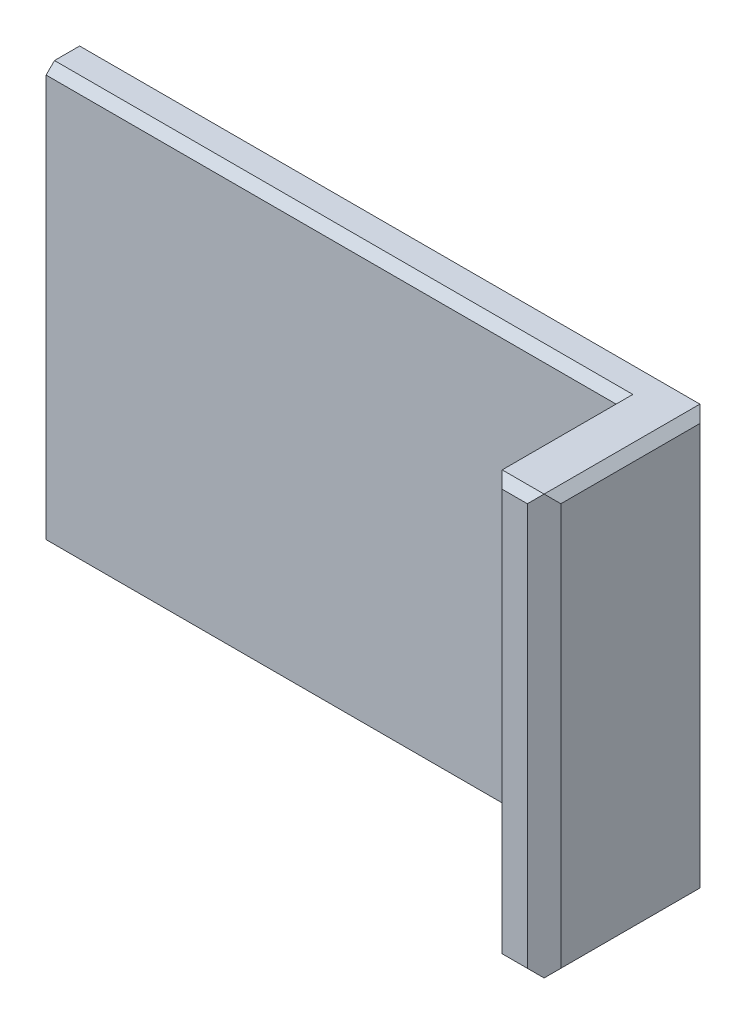
ISO-10303-21;
HEADER;
FILE_DESCRIPTION(('STEP AP214'),'2;1');
FILE_NAME('part.step','',(''),(''),'','','');
FILE_SCHEMA(('AUTOMOTIVE_DESIGN { 1 0 10303 214 1 1 1 1 }'));
ENDSEC;
DATA;
#1=APPLICATION_CONTEXT('core data for automotive mechanical design processes');
#2=APPLICATION_PROTOCOL_DEFINITION('international standard','automotive_design',2000,#1);
#3=PRODUCT_CONTEXT('',#1,'mechanical');
#4=PRODUCT('Part','Part','',(#3));
#5=PRODUCT_RELATED_PRODUCT_CATEGORY('part','',(#4));
#6=PRODUCT_DEFINITION_FORMATION('','',#4);
#7=PRODUCT_DEFINITION_CONTEXT('part definition',#1,'design');
#8=PRODUCT_DEFINITION('design','',#6,#7);
#9=PRODUCT_DEFINITION_SHAPE('','',#8);
#10=(LENGTH_UNIT() NAMED_UNIT(*) SI_UNIT(.MILLI.,.METRE.));
#11=(NAMED_UNIT(*) PLANE_ANGLE_UNIT() SI_UNIT($,.RADIAN.));
#12=(NAMED_UNIT(*) SI_UNIT($,.STERADIAN.) SOLID_ANGLE_UNIT());
#13=UNCERTAINTY_MEASURE_WITH_UNIT(LENGTH_MEASURE(1.E-05),#10,'distance_accuracy_value','');
#14=(GEOMETRIC_REPRESENTATION_CONTEXT(3) GLOBAL_UNCERTAINTY_ASSIGNED_CONTEXT((#13)) GLOBAL_UNIT_ASSIGNED_CONTEXT((#10,
#11,#12)) REPRESENTATION_CONTEXT('',''));
#15=CARTESIAN_POINT('',(0.,0.,0.));
#16=DIRECTION('',(0.,0.,1.));
#17=DIRECTION('',(1.,0.,0.));
#18=AXIS2_PLACEMENT_3D('',#15,#16,#17);
#19=CARTESIAN_POINT('',(5.,64.,0.));
#20=DIRECTION('',(1.,0.,0.));
#21=DIRECTION('',(0.,0.,-1.));
#22=AXIS2_PLACEMENT_3D('',#19,#20,#21);
#23=PLANE('',#22);
#24=CARTESIAN_POINT('',(5.,37.5,-7.5));
#25=DIRECTION('',(-1.,0.,0.));
#26=DIRECTION('',(0.,0.,1.));
#27=AXIS2_PLACEMENT_3D('',#24,#25,#26);
#28=CIRCLE('',#27,2.5);
#29=CARTESIAN_POINT('',(5.,37.5,-5.));
#30=VERTEX_POINT('',#29);
#31=EDGE_CURVE('E831',#30,#30,#28,.T.);
#32=ORIENTED_EDGE('',*,*,#31,.F.);
#33=EDGE_LOOP('',(#32));
#34=FACE_BOUND('',#33,.T.);
#35=CARTESIAN_POINT('',(5.,25.,-7.5));
#36=DIRECTION('',(-1.,0.,0.));
#37=DIRECTION('',(0.,0.,1.));
#38=AXIS2_PLACEMENT_3D('',#35,#36,#37);
#39=CIRCLE('',#38,2.5);
#40=CARTESIAN_POINT('',(5.,25.,-5.));
#41=VERTEX_POINT('',#40);
#42=EDGE_CURVE('E839',#41,#41,#39,.T.);
#43=ORIENTED_EDGE('',*,*,#42,.F.);
#44=EDGE_LOOP('',(#43));
#45=FACE_BOUND('',#44,.T.);
#46=CARTESIAN_POINT('',(5.,12.5,-7.5));
#47=DIRECTION('',(-1.,0.,0.));
#48=DIRECTION('',(0.,0.,1.));
#49=AXIS2_PLACEMENT_3D('',#46,#47,#48);
#50=CIRCLE('',#49,2.5);
#51=CARTESIAN_POINT('',(5.,12.5,-5.));
#52=VERTEX_POINT('',#51);
#53=EDGE_CURVE('E845',#52,#52,#50,.T.);
#54=ORIENTED_EDGE('',*,*,#53,.F.);
#55=EDGE_LOOP('',(#54));
#56=FACE_BOUND('',#55,.T.);
#57=DIRECTION('',(0.,0.707106781186546,-0.707106781186549));
#58=VECTOR('',#57,1.);
#59=CARTESIAN_POINT('',(5.,50.,-1.00000000000001));
#60=LINE('',#59,#58);
#61=CARTESIAN_POINT('',(5.,49.,0.));
#62=VERTEX_POINT('',#61);
#63=CARTESIAN_POINT('',(5.,50.,-1.00000000000001));
#64=VERTEX_POINT('',#63);
#65=EDGE_CURVE('E853',#62,#64,#60,.T.);
#66=ORIENTED_EDGE('',*,*,#65,.T.);
#67=DIRECTION('',(0.,0.,-1.));
#68=VECTOR('',#67,1.);
#69=CARTESIAN_POINT('',(5.,50.,0.));
#70=LINE('',#69,#68);
#71=CARTESIAN_POINT('',(5.,50.,-3.99999999999994));
#72=VERTEX_POINT('',#71);
#73=EDGE_CURVE('E851',#64,#72,#70,.T.);
#74=ORIENTED_EDGE('',*,*,#73,.T.);
#75=DIRECTION('',(0.,-0.707106781186546,-0.707106781186549));
#76=VECTOR('',#75,1.);
#77=CARTESIAN_POINT('',(5.,39.,-15.));
#78=LINE('',#77,#76);
#79=CARTESIAN_POINT('',(5.,39.,-15.));
#80=VERTEX_POINT('',#79);
#81=EDGE_CURVE('E849',#72,#80,#78,.T.);
#82=ORIENTED_EDGE('',*,*,#81,.T.);
#83=DIRECTION('',(0.,1.,0.));
#84=VECTOR('',#83,1.);
#85=CARTESIAN_POINT('',(5.,0.,-15.));
#86=LINE('',#85,#84);
#87=CARTESIAN_POINT('',(5.,11.,-15.));
#88=VERTEX_POINT('',#87);
#89=EDGE_CURVE('E618',#88,#80,#86,.T.);
#90=ORIENTED_EDGE('',*,*,#89,.F.);
#91=DIRECTION('',(0.,0.707106781186547,-0.707106781186548));
#92=VECTOR('',#91,1.);
#93=CARTESIAN_POINT('',(5.,11.,-15.));
#94=LINE('',#93,#92);
#95=CARTESIAN_POINT('',(5.,0.,-3.99999999999999));
#96=VERTEX_POINT('',#95);
#97=EDGE_CURVE('E725',#88,#96,#94,.F.);
#98=ORIENTED_EDGE('',*,*,#97,.T.);
#99=DIRECTION('',(0.,0.,1.));
#100=VECTOR('',#99,1.);
#101=CARTESIAN_POINT('',(5.,0.,0.));
#102=LINE('',#101,#100);
#103=CARTESIAN_POINT('',(5.,0.,-1.00000000000003));
#104=VERTEX_POINT('',#103);
#105=EDGE_CURVE('E727',#96,#104,#102,.T.);
#106=ORIENTED_EDGE('',*,*,#105,.T.);
#107=DIRECTION('',(0.,-0.707106781186538,-0.707106781186557));
#108=VECTOR('',#107,1.);
#109=CARTESIAN_POINT('',(5.,1.,0.));
#110=LINE('',#109,#108);
#111=CARTESIAN_POINT('',(5.,1.,0.));
#112=VERTEX_POINT('',#111);
#113=EDGE_CURVE('E855',#104,#112,#110,.F.);
#114=ORIENTED_EDGE('',*,*,#113,.T.);
#115=DIRECTION('',(0.,-1.,0.));
#116=VECTOR('',#115,1.);
#117=CARTESIAN_POINT('',(5.,50.,0.));
#118=LINE('',#117,#116);
#119=EDGE_CURVE('E872',#62,#112,#118,.T.);
#120=ORIENTED_EDGE('',*,*,#119,.F.);
#121=EDGE_LOOP('',(#66,#74,#82,#90,#98,#106,#114,#120));
#122=FACE_BOUND('',#121,.T.);
#123=ADVANCED_FACE('F600',(#34,#45,#56,#122),#23,.F.);
#124=CARTESIAN_POINT('',(0.,49.,-5.));
#125=DIRECTION('',(0.,-0.707106781186549,0.707106781186546));
#126=DIRECTION('',(1.,0.,0.));
#127=AXIS2_PLACEMENT_3D('',#124,#125,#126);
#128=PLANE('',#127);
#129=DIRECTION('',(0.,0.707106781186546,0.707106781186549));
#130=VECTOR('',#129,1.);
#131=CARTESIAN_POINT('',(23.4800344912998,20.0000000000001,-34.));
#132=LINE('',#131,#130);
#133=CARTESIAN_POINT('',(23.4800344912998,50.,-3.99999999999999));
#134=VERTEX_POINT('',#133);
#135=CARTESIAN_POINT('',(23.4800344912998,39.,-15.));
#136=VERTEX_POINT('',#135);
#137=EDGE_CURVE('E746',#134,#136,#132,.F.);
#138=ORIENTED_EDGE('',*,*,#137,.F.);
#139=DIRECTION('',(-1.,0.,0.));
#140=VECTOR('',#139,1.);
#141=CARTESIAN_POINT('',(0.,50.,-3.99999999999999));
#142=LINE('',#141,#140);
#143=CARTESIAN_POINT('',(79.,50.,-3.99999999999999));
#144=VERTEX_POINT('',#143);
#145=EDGE_CURVE('E887',#144,#134,#142,.T.);
#146=ORIENTED_EDGE('',*,*,#145,.F.);
#147=DIRECTION('',(0.577350269189621,0.577350269189627,0.57735026918963));
#148=VECTOR('',#147,1.);
#149=CARTESIAN_POINT('',(52.0000000000005,23.0000000000002,-31.));
#150=LINE('',#149,#148);
#151=CARTESIAN_POINT('',(78.0000000000001,49.,-4.99999999999999));
#152=VERTEX_POINT('',#151);
#153=EDGE_CURVE('E937',#144,#152,#150,.F.);
#154=ORIENTED_EDGE('',*,*,#153,.T.);
#155=DIRECTION('',(1.,0.,0.));
#156=VECTOR('',#155,1.);
#157=CARTESIAN_POINT('',(0.,49.,-5.));
#158=LINE('',#157,#156);
#159=CARTESIAN_POINT('',(33.4800344912997,49.,-5.));
#160=VERTEX_POINT('',#159);
#161=EDGE_CURVE('E892',#160,#152,#158,.T.);
#162=ORIENTED_EDGE('',*,*,#161,.F.);
#163=DIRECTION('',(0.577350269189624,0.577350269189625,0.577350269189628));
#164=VECTOR('',#163,1.);
#165=CARTESIAN_POINT('',(10.8133678246331,26.3333333333334,-27.6666666666667));
#166=LINE('',#165,#164);
#167=EDGE_CURVE('E755',#160,#136,#166,.F.);
#168=ORIENTED_EDGE('',*,*,#167,.T.);
#169=EDGE_LOOP('',(#138,#146,#154,#162,#168));
#170=FACE_BOUND('',#169,.T.);
#171=ADVANCED_FACE('F794',(#170),#128,.F.);
#172=CARTESIAN_POINT('',(0.,0.,-3.99999999999997));
#173=DIRECTION('',(0.,-0.707106781186557,-0.707106781186538));
#174=DIRECTION('',(-1.,0.,0.));
#175=AXIS2_PLACEMENT_3D('',#172,#173,#174);
#176=PLANE('',#175);
#177=DIRECTION('',(1.,0.,0.));
#178=VECTOR('',#177,1.);
#179=CARTESIAN_POINT('',(80.,0.,-3.99999999999997));
#180=LINE('',#179,#178);
#181=CARTESIAN_POINT('',(23.4800344912998,0.,-3.99999999999997));
#182=VERTEX_POINT('',#181);
#183=CARTESIAN_POINT('',(79.,0.,-3.99999999999997));
#184=VERTEX_POINT('',#183);
#185=EDGE_CURVE('E916',#182,#184,#180,.T.);
#186=ORIENTED_EDGE('',*,*,#185,.F.);
#187=DIRECTION('',(0.,-0.707106781186538,0.707106781186557));
#188=VECTOR('',#187,1.);
#189=CARTESIAN_POINT('',(23.4800344912998,6.,-10.0000000000001));
#190=LINE('',#189,#188);
#191=CARTESIAN_POINT('',(23.4800344912998,10.9999999999997,-15.));
#192=VERTEX_POINT('',#191);
#193=EDGE_CURVE('E742',#192,#182,#190,.T.);
#194=ORIENTED_EDGE('',*,*,#193,.F.);
#195=DIRECTION('',(0.577350269189628,-0.577350269189617,0.577350269189633));
#196=VECTOR('',#195,1.);
#197=CARTESIAN_POINT('',(26.813367824633,7.66666666666659,-11.6666666666668));
#198=LINE('',#197,#196);
#199=CARTESIAN_POINT('',(33.4800344912997,1.,-5.));
#200=VERTEX_POINT('',#199);
#201=EDGE_CURVE('E626',#192,#200,#198,.T.);
#202=ORIENTED_EDGE('',*,*,#201,.T.);
#203=DIRECTION('',(-1.,0.,0.));
#204=VECTOR('',#203,1.);
#205=CARTESIAN_POINT('',(0.,1.,-5.));
#206=LINE('',#205,#204);
#207=CARTESIAN_POINT('',(78.0000000000001,1.,-4.99999999999999));
#208=VERTEX_POINT('',#207);
#209=EDGE_CURVE('E890',#208,#200,#206,.T.);
#210=ORIENTED_EDGE('',*,*,#209,.F.);
#211=DIRECTION('',(0.577350269189625,-0.577350269189618,0.577350269189634));
#212=VECTOR('',#211,1.);
#213=CARTESIAN_POINT('',(52.6666666666667,26.333333333333,-30.3333333333337));
#214=LINE('',#213,#212);
#215=EDGE_CURVE('E927',#208,#184,#214,.T.);
#216=ORIENTED_EDGE('',*,*,#215,.T.);
#217=EDGE_LOOP('',(#186,#194,#202,#210,#216));
#218=FACE_BOUND('',#217,.T.);
#219=ADVANCED_FACE('F800',(#218),#176,.T.);
#220=CARTESIAN_POINT('',(0.,50.,0.));
#221=DIRECTION('',(0.,0.,-1.));
#222=DIRECTION('',(-1.,0.,0.));
#223=AXIS2_PLACEMENT_3D('',#220,#221,#222);
#224=PLANE('',#223);
#225=DIRECTION('',(0.,-1.,0.));
#226=VECTOR('',#225,1.);
#227=CARTESIAN_POINT('',(73.,50.,0.));
#228=LINE('',#227,#226);
#229=CARTESIAN_POINT('',(73.,49.,0.));
#230=VERTEX_POINT('',#229);
#231=CARTESIAN_POINT('',(73.,1.,0.));
#232=VERTEX_POINT('',#231);
#233=EDGE_CURVE('E869',#230,#232,#228,.T.);
#234=ORIENTED_EDGE('',*,*,#233,.F.);
#235=DIRECTION('',(-1.,0.,0.));
#236=VECTOR('',#235,1.);
#237=CARTESIAN_POINT('',(5.,49.,0.));
#238=LINE('',#237,#236);
#239=EDGE_CURVE('E913',#230,#62,#238,.T.);
#240=ORIENTED_EDGE('',*,*,#239,.T.);
#241=ORIENTED_EDGE('',*,*,#119,.T.);
#242=DIRECTION('',(1.,0.,0.));
#243=VECTOR('',#242,1.);
#244=CARTESIAN_POINT('',(0.,1.,0.));
#245=LINE('',#244,#243);
#246=EDGE_CURVE('E911',#112,#232,#245,.T.);
#247=ORIENTED_EDGE('',*,*,#246,.T.);
#248=EDGE_LOOP('',(#234,#240,#241,#247));
#249=FACE_BOUND('',#248,.T.);
#250=ADVANCED_FACE('F1032',(#249),#224,.F.);
#251=CARTESIAN_POINT('',(0.,50.,-5.));
#252=DIRECTION('',(0.,0.,-1.));
#253=DIRECTION('',(-1.,0.,0.));
#254=AXIS2_PLACEMENT_3D('',#251,#252,#253);
#255=PLANE('',#254);
#256=ORIENTED_EDGE('',*,*,#209,.T.);
#257=DIRECTION('',(0.,1.,0.));
#258=VECTOR('',#257,1.);
#259=CARTESIAN_POINT('',(33.4800344912997,50.,-5.));
#260=LINE('',#259,#258);
#261=EDGE_CURVE('E745',#200,#160,#260,.T.);
#262=ORIENTED_EDGE('',*,*,#261,.T.);
#263=ORIENTED_EDGE('',*,*,#161,.T.);
#264=DIRECTION('',(0.,-1.,0.));
#265=VECTOR('',#264,1.);
#266=CARTESIAN_POINT('',(78.0000000000001,1.,-4.99999999999999));
#267=LINE('',#266,#265);
#268=EDGE_CURVE('E934',#152,#208,#267,.T.);
#269=ORIENTED_EDGE('',*,*,#268,.T.);
#270=EDGE_LOOP('',(#256,#262,#263,#269));
#271=FACE_BOUND('',#270,.T.);
#272=ADVANCED_FACE('F1183',(#271),#255,.T.);
#273=CARTESIAN_POINT('',(0.,50.,0.));
#274=DIRECTION('',(0.,1.,0.));
#275=DIRECTION('',(0.,0.,1.));
#276=AXIS2_PLACEMENT_3D('',#273,#274,#275);
#277=PLANE('',#276);
#278=ORIENTED_EDGE('',*,*,#73,.F.);
#279=DIRECTION('',(1.,0.,0.));
#280=VECTOR('',#279,1.);
#281=CARTESIAN_POINT('',(73.,50.,-1.00000000000001));
#282=LINE('',#281,#280);
#283=CARTESIAN_POINT('',(74.,50.,-1.00000000000001));
#284=VERTEX_POINT('',#283);
#285=EDGE_CURVE('E876',#64,#284,#282,.T.);
#286=ORIENTED_EDGE('',*,*,#285,.T.);
#287=DIRECTION('',(0.,0.,1.));
#288=VECTOR('',#287,1.);
#289=CARTESIAN_POINT('',(74.,50.,0.));
#290=LINE('',#289,#288);
#291=CARTESIAN_POINT('',(74.,50.,14.5866666666667));
#292=VERTEX_POINT('',#291);
#293=EDGE_CURVE('E878',#284,#292,#290,.T.);
#294=ORIENTED_EDGE('',*,*,#293,.T.);
#295=DIRECTION('',(1.,0.,0.));
#296=VECTOR('',#295,1.);
#297=CARTESIAN_POINT('',(80.,50.,14.5866666666667));
#298=LINE('',#297,#296);
#299=CARTESIAN_POINT('',(79.,50.,14.5866666666667));
#300=VERTEX_POINT('',#299);
#301=EDGE_CURVE('E881',#292,#300,#298,.T.);
#302=ORIENTED_EDGE('',*,*,#301,.T.);
#303=DIRECTION('',(0.,0.,-1.));
#304=VECTOR('',#303,1.);
#305=CARTESIAN_POINT('',(79.,50.,-5.00000000000001));
#306=LINE('',#305,#304);
#307=EDGE_CURVE('E884',#300,#144,#306,.T.);
#308=ORIENTED_EDGE('',*,*,#307,.T.);
#309=ORIENTED_EDGE('',*,*,#145,.T.);
#310=DIRECTION('',(-1.,0.,0.));
#311=VECTOR('',#310,1.);
#312=CARTESIAN_POINT('',(0.,50.,-3.99999999999994));
#313=LINE('',#312,#311);
#314=EDGE_CURVE('E610',#134,#72,#313,.T.);
#315=ORIENTED_EDGE('',*,*,#314,.T.);
#316=EDGE_LOOP('',(#278,#286,#294,#302,#308,#309,#315));
#317=FACE_BOUND('',#316,.T.);
#318=ADVANCED_FACE('F991',(#317),#277,.T.);
#319=CARTESIAN_POINT('',(0.,0.,0.));
#320=DIRECTION('',(0.,1.,0.));
#321=DIRECTION('',(0.,0.,1.));
#322=AXIS2_PLACEMENT_3D('',#319,#320,#321);
#323=PLANE('',#322);
#324=DIRECTION('',(-1.,0.,0.));
#325=VECTOR('',#324,1.);
#326=CARTESIAN_POINT('',(0.,0.,-1.00000000000003));
#327=LINE('',#326,#325);
#328=CARTESIAN_POINT('',(74.,0.,-1.00000000000003));
#329=VERTEX_POINT('',#328);
#330=EDGE_CURVE('E739',#329,#104,#327,.T.);
#331=ORIENTED_EDGE('',*,*,#330,.T.);
#332=ORIENTED_EDGE('',*,*,#105,.F.);
#333=DIRECTION('',(1.,0.,0.));
#334=VECTOR('',#333,1.);
#335=CARTESIAN_POINT('',(0.,0.,-3.99999999999999));
#336=LINE('',#335,#334);
#337=EDGE_CURVE('E12',#96,#182,#336,.T.);
#338=ORIENTED_EDGE('',*,*,#337,.T.);
#339=ORIENTED_EDGE('',*,*,#185,.T.);
#340=DIRECTION('',(0.,0.,1.));
#341=VECTOR('',#340,1.);
#342=CARTESIAN_POINT('',(79.,0.,0.));
#343=LINE('',#342,#341);
#344=CARTESIAN_POINT('',(79.,0.,14.5866666666666));
#345=VERTEX_POINT('',#344);
#346=EDGE_CURVE('E918',#184,#345,#343,.T.);
#347=ORIENTED_EDGE('',*,*,#346,.T.);
#348=DIRECTION('',(-1.,0.,0.));
#349=VECTOR('',#348,1.);
#350=CARTESIAN_POINT('',(0.,0.,14.5866666666666));
#351=LINE('',#350,#349);
#352=CARTESIAN_POINT('',(74.,0.,14.5866666666666));
#353=VERTEX_POINT('',#352);
#354=EDGE_CURVE('E921',#345,#353,#351,.T.);
#355=ORIENTED_EDGE('',*,*,#354,.T.);
#356=DIRECTION('',(0.,0.,-1.));
#357=VECTOR('',#356,1.);
#358=CARTESIAN_POINT('',(74.,0.,0.));
#359=LINE('',#358,#357);
#360=EDGE_CURVE('E924',#353,#329,#359,.T.);
#361=ORIENTED_EDGE('',*,*,#360,.T.);
#362=EDGE_LOOP('',(#331,#332,#338,#339,#347,#355,#361));
#363=FACE_BOUND('',#362,.T.);
#364=ADVANCED_FACE('F736',(#363),#323,.F.);
#365=CARTESIAN_POINT('',(80.,50.,15.5866666666667));
#366=DIRECTION('',(-1.,0.,0.));
#367=DIRECTION('',(0.,0.,1.));
#368=AXIS2_PLACEMENT_3D('',#365,#366,#367);
#369=PLANE('',#368);
#370=DIRECTION('',(0.,0.,-1.));
#371=VECTOR('',#370,1.);
#372=CARTESIAN_POINT('',(80.,1.,15.5866666666667));
#373=LINE('',#372,#371);
#374=CARTESIAN_POINT('',(80.,1.,13.5866666666667));
#375=VERTEX_POINT('',#374);
#376=CARTESIAN_POINT('',(80.,1.,-3.00000000000002));
#377=VERTEX_POINT('',#376);
#378=EDGE_CURVE('E894',#375,#377,#373,.T.);
#379=ORIENTED_EDGE('',*,*,#378,.T.);
#380=DIRECTION('',(0.,1.,0.));
#381=VECTOR('',#380,1.);
#382=CARTESIAN_POINT('',(80.,49.,-3.00000000000002));
#383=LINE('',#382,#381);
#384=CARTESIAN_POINT('',(80.,49.,-3.00000000000002));
#385=VERTEX_POINT('',#384);
#386=EDGE_CURVE('E947',#377,#385,#383,.T.);
#387=ORIENTED_EDGE('',*,*,#386,.T.);
#388=DIRECTION('',(0.,0.,1.));
#389=VECTOR('',#388,1.);
#390=CARTESIAN_POINT('',(80.,49.,15.5866666666667));
#391=LINE('',#390,#389);
#392=CARTESIAN_POINT('',(80.,49.,13.5866666666667));
#393=VERTEX_POINT('',#392);
#394=EDGE_CURVE('E897',#385,#393,#391,.T.);
#395=ORIENTED_EDGE('',*,*,#394,.T.);
#396=DIRECTION('',(0.,-1.,0.));
#397=VECTOR('',#396,1.);
#398=CARTESIAN_POINT('',(80.,50.,13.5866666666667));
#399=LINE('',#398,#397);
#400=EDGE_CURVE('E944',#393,#375,#399,.T.);
#401=ORIENTED_EDGE('',*,*,#400,.T.);
#402=EDGE_LOOP('',(#379,#387,#395,#401));
#403=FACE_BOUND('',#402,.T.);
#404=ADVANCED_FACE('F1010',(#403),#369,.F.);
#405=CARTESIAN_POINT('',(75.,50.,15.5866666666667));
#406=DIRECTION('',(0.,0.,-1.));
#407=DIRECTION('',(-1.,0.,0.));
#408=AXIS2_PLACEMENT_3D('',#405,#406,#407);
#409=PLANE('',#408);
#410=DIRECTION('',(1.,0.,0.));
#411=VECTOR('',#410,1.);
#412=CARTESIAN_POINT('',(75.,1.,15.5866666666667));
#413=LINE('',#412,#411);
#414=CARTESIAN_POINT('',(75.,1.,15.5866666666667));
#415=VERTEX_POINT('',#414);
#416=CARTESIAN_POINT('',(78.,1.,15.5866666666667));
#417=VERTEX_POINT('',#416);
#418=EDGE_CURVE('E900',#415,#417,#413,.T.);
#419=ORIENTED_EDGE('',*,*,#418,.T.);
#420=DIRECTION('',(0.,1.,0.));
#421=VECTOR('',#420,1.);
#422=CARTESIAN_POINT('',(78.,50.,15.5866666666667));
#423=LINE('',#422,#421);
#424=CARTESIAN_POINT('',(78.,49.,15.5866666666667));
#425=VERTEX_POINT('',#424);
#426=EDGE_CURVE('E959',#417,#425,#423,.T.);
#427=ORIENTED_EDGE('',*,*,#426,.T.);
#428=DIRECTION('',(-1.,0.,0.));
#429=VECTOR('',#428,1.);
#430=CARTESIAN_POINT('',(73.,49.,15.5866666666667));
#431=LINE('',#430,#429);
#432=CARTESIAN_POINT('',(75.,49.,15.5866666666667));
#433=VERTEX_POINT('',#432);
#434=EDGE_CURVE('E903',#425,#433,#431,.T.);
#435=ORIENTED_EDGE('',*,*,#434,.T.);
#436=DIRECTION('',(0.,-1.,0.));
#437=VECTOR('',#436,1.);
#438=CARTESIAN_POINT('',(75.,1.,15.5866666666667));
#439=LINE('',#438,#437);
#440=EDGE_CURVE('E957',#433,#415,#439,.T.);
#441=ORIENTED_EDGE('',*,*,#440,.T.);
#442=EDGE_LOOP('',(#419,#427,#435,#441));
#443=FACE_BOUND('',#442,.T.);
#444=ADVANCED_FACE('F1069',(#443),#409,.F.);
#445=CARTESIAN_POINT('',(73.,0.,0.));
#446=DIRECTION('',(-1.,0.,0.));
#447=DIRECTION('',(0.,0.,1.));
#448=AXIS2_PLACEMENT_3D('',#445,#446,#447);
#449=PLANE('',#448);
#450=DIRECTION('',(0.,0.,1.));
#451=VECTOR('',#450,1.);
#452=CARTESIAN_POINT('',(73.,1.,15.5866666666667));
#453=LINE('',#452,#451);
#454=CARTESIAN_POINT('',(73.,1.,13.5866666666667));
#455=VERTEX_POINT('',#454);
#456=EDGE_CURVE('E906',#232,#455,#453,.T.);
#457=ORIENTED_EDGE('',*,*,#456,.T.);
#458=DIRECTION('',(0.,1.,0.));
#459=VECTOR('',#458,1.);
#460=CARTESIAN_POINT('',(73.,49.,13.5866666666667));
#461=LINE('',#460,#459);
#462=CARTESIAN_POINT('',(73.,49.,13.5866666666667));
#463=VERTEX_POINT('',#462);
#464=EDGE_CURVE('E965',#455,#463,#461,.T.);
#465=ORIENTED_EDGE('',*,*,#464,.T.);
#466=DIRECTION('',(0.,0.,-1.));
#467=VECTOR('',#466,1.);
#468=CARTESIAN_POINT('',(73.,49.,0.));
#469=LINE('',#468,#467);
#470=EDGE_CURVE('E909',#463,#230,#469,.T.);
#471=ORIENTED_EDGE('',*,*,#470,.T.);
#472=ORIENTED_EDGE('',*,*,#233,.T.);
#473=EDGE_LOOP('',(#457,#465,#471,#472));
#474=FACE_BOUND('',#473,.T.);
#475=ADVANCED_FACE('F979',(#474),#449,.T.);
#476=CARTESIAN_POINT('',(0.,50.,-1.00000000000001));
#477=DIRECTION('',(0.,0.707106781186549,0.707106781186546));
#478=DIRECTION('',(-1.,0.,0.));
#479=AXIS2_PLACEMENT_3D('',#476,#477,#478);
#480=PLANE('',#479);
#481=ORIENTED_EDGE('',*,*,#65,.F.);
#482=ORIENTED_EDGE('',*,*,#239,.F.);
#483=DIRECTION('',(-0.577350269189625,-0.577350269189625,0.577350269189628));
#484=VECTOR('',#483,1.);
#485=CARTESIAN_POINT('',(73.,49.,0.));
#486=LINE('',#485,#484);
#487=EDGE_CURVE('E873',#284,#230,#486,.T.);
#488=ORIENTED_EDGE('',*,*,#487,.F.);
#489=ORIENTED_EDGE('',*,*,#285,.F.);
#490=EDGE_LOOP('',(#481,#482,#488,#489));
#491=FACE_BOUND('',#490,.T.);
#492=ADVANCED_FACE('F1029',(#491),#480,.T.);
#493=CARTESIAN_POINT('',(73.,49.,0.));
#494=DIRECTION('',(0.707106781186547,-0.707106781186547,0.));
#495=DIRECTION('',(0.,0.,-1.));
#496=AXIS2_PLACEMENT_3D('',#493,#494,#495);
#497=PLANE('',#496);
#498=ORIENTED_EDGE('',*,*,#470,.F.);
#499=DIRECTION('',(-0.577350269189626,-0.577350269189626,-0.577350269189626));
#500=VECTOR('',#499,1.);
#501=CARTESIAN_POINT('',(68.4711111111111,44.4711111111111,9.05777777777778));
#502=LINE('',#501,#500);
#503=EDGE_CURVE('E968',#463,#292,#502,.F.);
#504=ORIENTED_EDGE('',*,*,#503,.T.);
#505=ORIENTED_EDGE('',*,*,#293,.F.);
#506=ORIENTED_EDGE('',*,*,#487,.T.);
#507=EDGE_LOOP('',(#498,#504,#505,#506));
#508=FACE_BOUND('',#507,.T.);
#509=ADVANCED_FACE('F987',(#508),#497,.F.);
#510=CARTESIAN_POINT('',(0.,50.,14.5866666666667));
#511=DIRECTION('',(0.,0.707106781186549,0.707106781186546));
#512=DIRECTION('',(-1.,0.,0.));
#513=AXIS2_PLACEMENT_3D('',#510,#511,#512);
#514=PLANE('',#513);
#515=ORIENTED_EDGE('',*,*,#434,.F.);
#516=DIRECTION('',(-0.577350269189627,-0.577350269189624,0.577350269189627));
#517=VECTOR('',#516,1.);
#518=CARTESIAN_POINT('',(52.6666666666666,23.6666666666667,40.9200000000001));
#519=LINE('',#518,#517);
#520=EDGE_CURVE('E963',#425,#300,#519,.F.);
#521=ORIENTED_EDGE('',*,*,#520,.T.);
#522=ORIENTED_EDGE('',*,*,#301,.F.);
#523=DIRECTION('',(0.577350269189627,-0.577350269189624,0.577350269189627));
#524=VECTOR('',#523,1.);
#525=CARTESIAN_POINT('',(49.3333333333332,74.6666666666666,-10.0800000000001));
#526=LINE('',#525,#524);
#527=EDGE_CURVE('E961',#292,#433,#526,.T.);
#528=ORIENTED_EDGE('',*,*,#527,.T.);
#529=EDGE_LOOP('',(#515,#521,#522,#528));
#530=FACE_BOUND('',#529,.T.);
#531=ADVANCED_FACE('F997',(#530),#514,.T.);
#532=CARTESIAN_POINT('',(79.,50.,0.));
#533=DIRECTION('',(0.707106781186547,0.707106781186547,0.));
#534=DIRECTION('',(0.,0.,1.));
#535=AXIS2_PLACEMENT_3D('',#532,#533,#534);
#536=PLANE('',#535);
#537=ORIENTED_EDGE('',*,*,#394,.F.);
#538=DIRECTION('',(-0.577350269189623,0.577350269189623,-0.577350269189632));
#539=VECTOR('',#538,1.);
#540=CARTESIAN_POINT('',(80.3333333333334,48.6666666666667,-2.66666666666666));
#541=LINE('',#540,#539);
#542=EDGE_CURVE('E951',#385,#144,#541,.T.);
#543=ORIENTED_EDGE('',*,*,#542,.T.);
#544=ORIENTED_EDGE('',*,*,#307,.F.);
#545=DIRECTION('',(-0.577350269189626,0.577350269189626,0.577350269189626));
#546=VECTOR('',#545,1.);
#547=CARTESIAN_POINT('',(83.8622222222222,45.1377777777778,9.72444444444445));
#548=LINE('',#547,#546);
#549=EDGE_CURVE('E949',#300,#393,#548,.F.);
#550=ORIENTED_EDGE('',*,*,#549,.T.);
#551=EDGE_LOOP('',(#537,#543,#544,#550));
#552=FACE_BOUND('',#551,.T.);
#553=ADVANCED_FACE('F1007',(#552),#536,.T.);
#554=CARTESIAN_POINT('',(80.,1.,15.5866666666667));
#555=DIRECTION('',(-0.707106781186538,0.707106781186557,0.));
#556=DIRECTION('',(0.,0.,-1.));
#557=AXIS2_PLACEMENT_3D('',#554,#555,#556);
#558=PLANE('',#557);
#559=ORIENTED_EDGE('',*,*,#346,.F.);
#560=DIRECTION('',(-0.577350269189628,-0.577350269189612,-0.577350269189637));
#561=VECTOR('',#560,1.);
#562=CARTESIAN_POINT('',(86.1955555555557,7.19555555555554,3.19555555555578));
#563=LINE('',#562,#561);
#564=EDGE_CURVE('E942',#184,#377,#563,.F.);
#565=ORIENTED_EDGE('',*,*,#564,.T.);
#566=ORIENTED_EDGE('',*,*,#378,.F.);
#567=DIRECTION('',(-0.577350269189631,-0.577350269189615,0.577350269189631));
#568=VECTOR('',#567,1.);
#569=CARTESIAN_POINT('',(79.3333333333333,0.33333333333334,14.2533333333333));
#570=LINE('',#569,#568);
#571=EDGE_CURVE('E940',#375,#345,#570,.T.);
#572=ORIENTED_EDGE('',*,*,#571,.T.);
#573=EDGE_LOOP('',(#559,#565,#566,#572));
#574=FACE_BOUND('',#573,.T.);
#575=ADVANCED_FACE('F1062',(#574),#558,.F.);
#576=CARTESIAN_POINT('',(75.,1.,15.5866666666667));
#577=DIRECTION('',(0.,0.707106781186557,-0.707106781186538));
#578=DIRECTION('',(1.,0.,0.));
#579=AXIS2_PLACEMENT_3D('',#576,#577,#578);
#580=PLANE('',#579);
#581=ORIENTED_EDGE('',*,*,#354,.F.);
#582=DIRECTION('',(-0.577350269189631,0.577350269189615,0.577350269189631));
#583=VECTOR('',#582,1.);
#584=CARTESIAN_POINT('',(77.,1.99999999999999,16.5866666666667));
#585=LINE('',#584,#583);
#586=EDGE_CURVE('E955',#345,#417,#585,.T.);
#587=ORIENTED_EDGE('',*,*,#586,.T.);
#588=ORIENTED_EDGE('',*,*,#418,.F.);
#589=DIRECTION('',(0.577350269189631,0.577350269189615,0.577350269189631));
#590=VECTOR('',#589,1.);
#591=CARTESIAN_POINT('',(75.,1.,15.5866666666667));
#592=LINE('',#591,#590);
#593=EDGE_CURVE('E953',#415,#353,#592,.F.);
#594=ORIENTED_EDGE('',*,*,#593,.T.);
#595=EDGE_LOOP('',(#581,#587,#588,#594));
#596=FACE_BOUND('',#595,.T.);
#597=ADVANCED_FACE('F1043',(#596),#580,.F.);
#598=CARTESIAN_POINT('',(73.,1.,0.));
#599=DIRECTION('',(-0.707106781186538,-0.707106781186557,0.));
#600=DIRECTION('',(0.,0.,-1.));
#601=AXIS2_PLACEMENT_3D('',#598,#599,#600);
#602=PLANE('',#601);
#603=ORIENTED_EDGE('',*,*,#360,.F.);
#604=DIRECTION('',(-0.577350269189631,0.577350269189615,-0.577350269189631));
#605=VECTOR('',#604,1.);
#606=CARTESIAN_POINT('',(68.471111111111,5.52888888888885,9.0577777777777));
#607=LINE('',#606,#605);
#608=EDGE_CURVE('E750',#353,#455,#607,.T.);
#609=ORIENTED_EDGE('',*,*,#608,.T.);
#610=ORIENTED_EDGE('',*,*,#456,.F.);
#611=DIRECTION('',(-0.577350269189631,0.577350269189615,0.577350269189631));
#612=VECTOR('',#611,1.);
#613=CARTESIAN_POINT('',(48.6666666666662,25.3333333333331,24.3333333333338));
#614=LINE('',#613,#612);
#615=EDGE_CURVE('E868',#329,#232,#614,.T.);
#616=ORIENTED_EDGE('',*,*,#615,.F.);
#617=EDGE_LOOP('',(#603,#609,#610,#616));
#618=FACE_BOUND('',#617,.T.);
#619=ADVANCED_FACE('F973',(#618),#602,.T.);
#620=CARTESIAN_POINT('',(0.,1.,0.));
#621=DIRECTION('',(0.,0.707106781186557,-0.707106781186538));
#622=DIRECTION('',(1.,0.,0.));
#623=AXIS2_PLACEMENT_3D('',#620,#621,#622);
#624=PLANE('',#623);
#625=ORIENTED_EDGE('',*,*,#113,.F.);
#626=ORIENTED_EDGE('',*,*,#330,.F.);
#627=ORIENTED_EDGE('',*,*,#615,.T.);
#628=ORIENTED_EDGE('',*,*,#246,.F.);
#629=EDGE_LOOP('',(#625,#626,#627,#628));
#630=FACE_BOUND('',#629,.T.);
#631=ADVANCED_FACE('F1035',(#630),#624,.F.);
#632=CARTESIAN_POINT('',(78.0000000000001,50.,-4.99999999999999));
#633=DIRECTION('',(0.707106781186553,0.,-0.707106781186542));
#634=DIRECTION('',(0.,1.,0.));
#635=AXIS2_PLACEMENT_3D('',#632,#633,#634);
#636=PLANE('',#635);
#637=ORIENTED_EDGE('',*,*,#542,.F.);
#638=ORIENTED_EDGE('',*,*,#386,.F.);
#639=ORIENTED_EDGE('',*,*,#564,.F.);
#640=ORIENTED_EDGE('',*,*,#215,.F.);
#641=ORIENTED_EDGE('',*,*,#268,.F.);
#642=ORIENTED_EDGE('',*,*,#153,.F.);
#643=EDGE_LOOP('',(#637,#638,#639,#640,#641,#642));
#644=FACE_BOUND('',#643,.T.);
#645=ADVANCED_FACE('F1015',(#644),#636,.T.);
#646=CARTESIAN_POINT('',(80.,50.,13.5866666666667));
#647=DIRECTION('',(-0.707106781186547,0.,-0.707106781186547));
#648=DIRECTION('',(0.,-1.,0.));
#649=AXIS2_PLACEMENT_3D('',#646,#647,#648);
#650=PLANE('',#649);
#651=ORIENTED_EDGE('',*,*,#520,.F.);
#652=ORIENTED_EDGE('',*,*,#426,.F.);
#653=ORIENTED_EDGE('',*,*,#586,.F.);
#654=ORIENTED_EDGE('',*,*,#571,.F.);
#655=ORIENTED_EDGE('',*,*,#400,.F.);
#656=ORIENTED_EDGE('',*,*,#549,.F.);
#657=EDGE_LOOP('',(#651,#652,#653,#654,#655,#656));
#658=FACE_BOUND('',#657,.T.);
#659=ADVANCED_FACE('F1002',(#658),#650,.F.);
#660=CARTESIAN_POINT('',(73.,0.,13.5866666666667));
#661=DIRECTION('',(-0.707106781186547,0.,0.707106781186547));
#662=DIRECTION('',(0.,-1.,0.));
#663=AXIS2_PLACEMENT_3D('',#660,#661,#662);
#664=PLANE('',#663);
#665=ORIENTED_EDGE('',*,*,#593,.F.);
#666=ORIENTED_EDGE('',*,*,#440,.F.);
#667=ORIENTED_EDGE('',*,*,#527,.F.);
#668=ORIENTED_EDGE('',*,*,#503,.F.);
#669=ORIENTED_EDGE('',*,*,#464,.F.);
#670=ORIENTED_EDGE('',*,*,#608,.F.);
#671=EDGE_LOOP('',(#665,#666,#667,#668,#669,#670));
#672=FACE_BOUND('',#671,.T.);
#673=ADVANCED_FACE('F982',(#672),#664,.T.);
#674=CARTESIAN_POINT('',(0.,0.,-15.));
#675=DIRECTION('',(0.,0.,1.));
#676=DIRECTION('',(1.,0.,0.));
#677=AXIS2_PLACEMENT_3D('',#674,#675,#676);
#678=PLANE('',#677);
#679=DIRECTION('',(-1.,0.,0.));
#680=VECTOR('',#679,1.);
#681=CARTESIAN_POINT('',(0.,11.,-15.));
#682=LINE('',#681,#680);
#683=EDGE_CURVE('E743',#192,#88,#682,.T.);
#684=ORIENTED_EDGE('',*,*,#683,.T.);
#685=ORIENTED_EDGE('',*,*,#89,.T.);
#686=DIRECTION('',(1.,0.,0.));
#687=VECTOR('',#686,1.);
#688=CARTESIAN_POINT('',(23.4800344912998,39.,-15.));
#689=LINE('',#688,#687);
#690=EDGE_CURVE('E759',#80,#136,#689,.T.);
#691=ORIENTED_EDGE('',*,*,#690,.T.);
#692=DIRECTION('',(0.,-1.,0.));
#693=VECTOR('',#692,1.);
#694=CARTESIAN_POINT('',(23.4800344912998,49.,-15.));
#695=LINE('',#694,#693);
#696=EDGE_CURVE('E861',#136,#192,#695,.T.);
#697=ORIENTED_EDGE('',*,*,#696,.T.);
#698=EDGE_LOOP('',(#684,#685,#691,#697));
#699=FACE_BOUND('',#698,.T.);
#700=ADVANCED_FACE('F1089',(#699),#678,.F.);
#701=CARTESIAN_POINT('',(23.4800344912998,1.,-15.));
#702=DIRECTION('',(-0.70710678118655,0.,0.707106781186545));
#703=DIRECTION('',(0.,-1.,0.));
#704=AXIS2_PLACEMENT_3D('',#701,#702,#703);
#705=PLANE('',#704);
#706=ORIENTED_EDGE('',*,*,#167,.F.);
#707=ORIENTED_EDGE('',*,*,#261,.F.);
#708=ORIENTED_EDGE('',*,*,#201,.F.);
#709=ORIENTED_EDGE('',*,*,#696,.F.);
#710=EDGE_LOOP('',(#706,#707,#708,#709));
#711=FACE_BOUND('',#710,.T.);
#712=ADVANCED_FACE('F1090',(#711),#705,.F.);
#713=CARTESIAN_POINT('',(0.,39.,-15.));
#714=DIRECTION('',(0.,0.707106781186549,-0.707106781186546));
#715=DIRECTION('',(-1.,0.,0.));
#716=AXIS2_PLACEMENT_3D('',#713,#714,#715);
#717=PLANE('',#716);
#718=ORIENTED_EDGE('',*,*,#81,.F.);
#719=ORIENTED_EDGE('',*,*,#314,.F.);
#720=ORIENTED_EDGE('',*,*,#137,.T.);
#721=ORIENTED_EDGE('',*,*,#690,.F.);
#722=EDGE_LOOP('',(#718,#719,#720,#721));
#723=FACE_BOUND('',#722,.T.);
#724=ADVANCED_FACE('F1026',(#723),#717,.T.);
#725=CARTESIAN_POINT('',(0.,11.,-15.));
#726=DIRECTION('',(0.,0.707106781186548,0.707106781186547));
#727=DIRECTION('',(-1.,0.,0.));
#728=AXIS2_PLACEMENT_3D('',#725,#726,#727);
#729=PLANE('',#728);
#730=ORIENTED_EDGE('',*,*,#97,.F.);
#731=ORIENTED_EDGE('',*,*,#683,.F.);
#732=ORIENTED_EDGE('',*,*,#193,.T.);
#733=ORIENTED_EDGE('',*,*,#337,.F.);
#734=EDGE_LOOP('',(#730,#731,#732,#733));
#735=FACE_BOUND('',#734,.T.);
#736=ADVANCED_FACE('F603',(#735),#729,.F.);
#737=CARTESIAN_POINT('',(15.,12.5,-7.5));
#738=DIRECTION('',(-1.,0.,0.));
#739=DIRECTION('',(0.,0.,1.));
#740=AXIS2_PLACEMENT_3D('',#737,#738,#739);
#741=PLANE('',#740);
#742=CARTESIAN_POINT('',(15.,12.5,-7.5));
#743=DIRECTION('',(-1.,0.,0.));
#744=DIRECTION('',(0.,0.,1.));
#745=AXIS2_PLACEMENT_3D('',#742,#743,#744);
#746=CIRCLE('',#745,2.5);
#747=CARTESIAN_POINT('',(15.,12.5,-5.));
#748=VERTEX_POINT('',#747);
#749=EDGE_CURVE('E842',#748,#748,#746,.T.);
#750=ORIENTED_EDGE('',*,*,#749,.T.);
#751=EDGE_LOOP('',(#750));
#752=FACE_BOUND('',#751,.T.);
#753=CARTESIAN_POINT('',(15.,12.5,-7.5));
#754=DIRECTION('',(-1.,0.,0.));
#755=DIRECTION('',(0.,0.,1.));
#756=AXIS2_PLACEMENT_3D('',#753,#754,#755);
#757=CIRCLE('',#756,1.55);
#758=CARTESIAN_POINT('',(15.,12.5,-5.95));
#759=VERTEX_POINT('',#758);
#760=EDGE_CURVE('E763',#759,#759,#757,.F.);
#761=ORIENTED_EDGE('',*,*,#760,.T.);
#762=EDGE_LOOP('',(#761));
#763=FACE_BOUND('',#762,.T.);
#764=ADVANCED_FACE('F810',(#752,#763),#741,.T.);
#765=CARTESIAN_POINT('',(15.,12.5,-7.5));
#766=DIRECTION('',(-1.,0.,0.));
#767=DIRECTION('',(0.,0.,1.));
#768=AXIS2_PLACEMENT_3D('',#765,#766,#767);
#769=CYLINDRICAL_SURFACE('',#768,2.5);
#770=ORIENTED_EDGE('',*,*,#749,.F.);
#771=EDGE_LOOP('',(#770));
#772=FACE_BOUND('',#771,.T.);
#773=ORIENTED_EDGE('',*,*,#53,.T.);
#774=EDGE_LOOP('',(#773));
#775=FACE_BOUND('',#774,.T.);
#776=ADVANCED_FACE('F806',(#772,#775),#769,.F.);
#777=CARTESIAN_POINT('',(15.,25.,-7.5));
#778=DIRECTION('',(-1.,0.,0.));
#779=DIRECTION('',(0.,0.,1.));
#780=AXIS2_PLACEMENT_3D('',#777,#778,#779);
#781=PLANE('',#780);
#782=CARTESIAN_POINT('',(15.,25.,-7.5));
#783=DIRECTION('',(-1.,0.,0.));
#784=DIRECTION('',(0.,0.,1.));
#785=AXIS2_PLACEMENT_3D('',#782,#783,#784);
#786=CIRCLE('',#785,2.5);
#787=CARTESIAN_POINT('',(15.,25.,-5.));
#788=VERTEX_POINT('',#787);
#789=EDGE_CURVE('E834',#788,#788,#786,.T.);
#790=ORIENTED_EDGE('',*,*,#789,.T.);
#791=EDGE_LOOP('',(#790));
#792=FACE_BOUND('',#791,.T.);
#793=CARTESIAN_POINT('',(15.,25.,-7.5));
#794=DIRECTION('',(-1.,0.,0.));
#795=DIRECTION('',(0.,0.,1.));
#796=AXIS2_PLACEMENT_3D('',#793,#794,#795);
#797=CIRCLE('',#796,1.55);
#798=CARTESIAN_POINT('',(15.,25.,-5.95));
#799=VERTEX_POINT('',#798);
#800=EDGE_CURVE('E765',#799,#799,#797,.F.);
#801=ORIENTED_EDGE('',*,*,#800,.T.);
#802=EDGE_LOOP('',(#801));
#803=FACE_BOUND('',#802,.T.);
#804=ADVANCED_FACE('F809',(#792,#803),#781,.T.);
#805=CARTESIAN_POINT('',(15.,25.,-7.5));
#806=DIRECTION('',(-1.,0.,0.));
#807=DIRECTION('',(0.,0.,1.));
#808=AXIS2_PLACEMENT_3D('',#805,#806,#807);
#809=CYLINDRICAL_SURFACE('',#808,2.5);
#810=ORIENTED_EDGE('',*,*,#789,.F.);
#811=EDGE_LOOP('',(#810));
#812=FACE_BOUND('',#811,.T.);
#813=ORIENTED_EDGE('',*,*,#42,.T.);
#814=EDGE_LOOP('',(#813));
#815=FACE_BOUND('',#814,.T.);
#816=ADVANCED_FACE('F815',(#812,#815),#809,.F.);
#817=CARTESIAN_POINT('',(15.,37.5,-7.5));
#818=DIRECTION('',(-1.,0.,0.));
#819=DIRECTION('',(0.,0.,1.));
#820=AXIS2_PLACEMENT_3D('',#817,#818,#819);
#821=PLANE('',#820);
#822=CARTESIAN_POINT('',(15.,37.5,-7.5));
#823=DIRECTION('',(-1.,0.,0.));
#824=DIRECTION('',(0.,0.,1.));
#825=AXIS2_PLACEMENT_3D('',#822,#823,#824);
#826=CIRCLE('',#825,2.5);
#827=CARTESIAN_POINT('',(15.,37.5,-5.));
#828=VERTEX_POINT('',#827);
#829=EDGE_CURVE('E766',#828,#828,#826,.T.);
#830=ORIENTED_EDGE('',*,*,#829,.T.);
#831=EDGE_LOOP('',(#830));
#832=FACE_BOUND('',#831,.T.);
#833=CARTESIAN_POINT('',(15.,37.5,-7.5));
#834=DIRECTION('',(-1.,0.,0.));
#835=DIRECTION('',(0.,0.,1.));
#836=AXIS2_PLACEMENT_3D('',#833,#834,#835);
#837=CIRCLE('',#836,1.55);
#838=CARTESIAN_POINT('',(15.,37.5,-5.95));
#839=VERTEX_POINT('',#838);
#840=EDGE_CURVE('E605',#839,#839,#837,.F.);
#841=ORIENTED_EDGE('',*,*,#840,.T.);
#842=EDGE_LOOP('',(#841));
#843=FACE_BOUND('',#842,.T.);
#844=ADVANCED_FACE('F773',(#832,#843),#821,.T.);
#845=CARTESIAN_POINT('',(15.,37.5,-7.5));
#846=DIRECTION('',(-1.,0.,0.));
#847=DIRECTION('',(0.,0.,1.));
#848=AXIS2_PLACEMENT_3D('',#845,#846,#847);
#849=CYLINDRICAL_SURFACE('',#848,2.5);
#850=ORIENTED_EDGE('',*,*,#829,.F.);
#851=EDGE_LOOP('',(#850));
#852=FACE_BOUND('',#851,.T.);
#853=ORIENTED_EDGE('',*,*,#31,.T.);
#854=EDGE_LOOP('',(#853));
#855=FACE_BOUND('',#854,.T.);
#856=ADVANCED_FACE('F788',(#852,#855),#849,.F.);
#857=CARTESIAN_POINT('',(25.,37.5,-7.5));
#858=DIRECTION('',(-1.,0.,0.));
#859=DIRECTION('',(0.,0.,1.));
#860=AXIS2_PLACEMENT_3D('',#857,#858,#859);
#861=PLANE('',#860);
#862=CARTESIAN_POINT('',(25.,37.5,-7.5));
#863=DIRECTION('',(-1.,0.,0.));
#864=DIRECTION('',(0.,0.,1.));
#865=AXIS2_PLACEMENT_3D('',#862,#863,#864);
#866=CIRCLE('',#865,1.55);
#867=CARTESIAN_POINT('',(25.,37.5,-5.95));
#868=VERTEX_POINT('',#867);
#869=EDGE_CURVE('E858',#868,#868,#866,.T.);
#870=ORIENTED_EDGE('',*,*,#869,.T.);
#871=EDGE_LOOP('',(#870));
#872=FACE_BOUND('',#871,.T.);
#873=ADVANCED_FACE('F778',(#872),#861,.T.);
#874=CARTESIAN_POINT('',(25.,37.5,-7.5));
#875=DIRECTION('',(-1.,0.,0.));
#876=DIRECTION('',(0.,0.,1.));
#877=AXIS2_PLACEMENT_3D('',#874,#875,#876);
#878=CYLINDRICAL_SURFACE('',#877,1.55);
#879=ORIENTED_EDGE('',*,*,#869,.F.);
#880=EDGE_LOOP('',(#879));
#881=FACE_BOUND('',#880,.T.);
#882=ORIENTED_EDGE('',*,*,#840,.F.);
#883=EDGE_LOOP('',(#882));
#884=FACE_BOUND('',#883,.T.);
#885=ADVANCED_FACE('F775',(#881,#884),#878,.F.);
#886=CARTESIAN_POINT('',(25.,12.5,-7.5));
#887=DIRECTION('',(-1.,0.,0.));
#888=DIRECTION('',(0.,0.,1.));
#889=AXIS2_PLACEMENT_3D('',#886,#887,#888);
#890=PLANE('',#889);
#891=CARTESIAN_POINT('',(25.,12.5,-7.5));
#892=DIRECTION('',(-1.,0.,0.));
#893=DIRECTION('',(0.,0.,1.));
#894=AXIS2_PLACEMENT_3D('',#891,#892,#893);
#895=CIRCLE('',#894,1.55);
#896=CARTESIAN_POINT('',(25.,12.5,-5.95));
#897=VERTEX_POINT('',#896);
#898=EDGE_CURVE('E857',#897,#897,#895,.T.);
#899=ORIENTED_EDGE('',*,*,#898,.T.);
#900=EDGE_LOOP('',(#899));
#901=FACE_BOUND('',#900,.T.);
#902=ADVANCED_FACE('F777',(#901),#890,.T.);
#903=CARTESIAN_POINT('',(25.,12.5,-7.5));
#904=DIRECTION('',(-1.,0.,0.));
#905=DIRECTION('',(0.,0.,1.));
#906=AXIS2_PLACEMENT_3D('',#903,#904,#905);
#907=CYLINDRICAL_SURFACE('',#906,1.55);
#908=ORIENTED_EDGE('',*,*,#898,.F.);
#909=EDGE_LOOP('',(#908));
#910=FACE_BOUND('',#909,.T.);
#911=ORIENTED_EDGE('',*,*,#760,.F.);
#912=EDGE_LOOP('',(#911));
#913=FACE_BOUND('',#912,.T.);
#914=ADVANCED_FACE('F785',(#910,#913),#907,.F.);
#915=CARTESIAN_POINT('',(25.,25.,-7.5));
#916=DIRECTION('',(-1.,0.,0.));
#917=DIRECTION('',(0.,0.,1.));
#918=AXIS2_PLACEMENT_3D('',#915,#916,#917);
#919=PLANE('',#918);
#920=CARTESIAN_POINT('',(25.,25.,-7.5));
#921=DIRECTION('',(-1.,0.,0.));
#922=DIRECTION('',(0.,0.,1.));
#923=AXIS2_PLACEMENT_3D('',#920,#921,#922);
#924=CIRCLE('',#923,1.55);
#925=CARTESIAN_POINT('',(25.,25.,-5.95));
#926=VERTEX_POINT('',#925);
#927=EDGE_CURVE('E862',#926,#926,#924,.T.);
#928=ORIENTED_EDGE('',*,*,#927,.T.);
#929=EDGE_LOOP('',(#928));
#930=FACE_BOUND('',#929,.T.);
#931=ADVANCED_FACE('F1144',(#930),#919,.T.);
#932=CARTESIAN_POINT('',(25.,25.,-7.5));
#933=DIRECTION('',(-1.,0.,0.));
#934=DIRECTION('',(0.,0.,1.));
#935=AXIS2_PLACEMENT_3D('',#932,#933,#934);
#936=CYLINDRICAL_SURFACE('',#935,1.55);
#937=ORIENTED_EDGE('',*,*,#927,.F.);
#938=EDGE_LOOP('',(#937));
#939=FACE_BOUND('',#938,.T.);
#940=ORIENTED_EDGE('',*,*,#800,.F.);
#941=EDGE_LOOP('',(#940));
#942=FACE_BOUND('',#941,.T.);
#943=ADVANCED_FACE('F1152',(#939,#942),#936,.F.);
#944=CLOSED_SHELL('',(#123,#171,#219,#250,#272,#318,#364,#404,#444,#475,#492,#509,#531,#553,
#575,#597,#619,#631,#645,#659,#673,#700,#712,#724,#736,#764,#776,#804,#816,#844,#856,#873,#885,
#902,#914,#931,#943));
#945=MANIFOLD_SOLID_BREP('B2',#944);
#946=ADVANCED_BREP_SHAPE_REPRESENTATION('',(#18,#945),#14);
#947=SHAPE_DEFINITION_REPRESENTATION(#9,#946);
ENDSEC;
END-ISO-10303-21;
